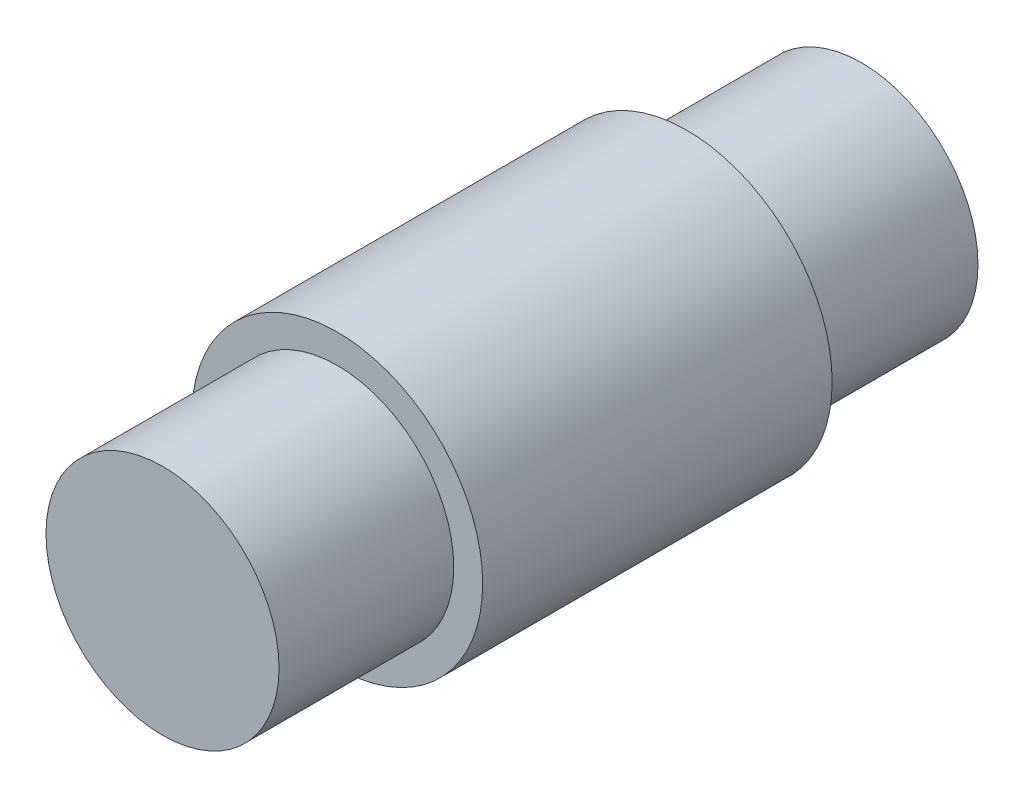
ISO-10303-21;
HEADER;
FILE_DESCRIPTION(('STEP AP214'),'2;1');
FILE_NAME('part.step','',(''),(''),'','','');
FILE_SCHEMA(('AUTOMOTIVE_DESIGN { 1 0 10303 214 1 1 1 1 }'));
ENDSEC;
DATA;
#1=APPLICATION_CONTEXT('core data for automotive mechanical design processes');
#2=APPLICATION_PROTOCOL_DEFINITION('international standard','automotive_design',2000,#1);
#3=PRODUCT_CONTEXT('',#1,'mechanical');
#4=PRODUCT('Part','Part','',(#3));
#5=PRODUCT_RELATED_PRODUCT_CATEGORY('part','',(#4));
#6=PRODUCT_DEFINITION_FORMATION('','',#4);
#7=PRODUCT_DEFINITION_CONTEXT('part definition',#1,'design');
#8=PRODUCT_DEFINITION('design','',#6,#7);
#9=PRODUCT_DEFINITION_SHAPE('','',#8);
#10=(LENGTH_UNIT() NAMED_UNIT(*) SI_UNIT(.MILLI.,.METRE.));
#11=(NAMED_UNIT(*) PLANE_ANGLE_UNIT() SI_UNIT($,.RADIAN.));
#12=(NAMED_UNIT(*) SI_UNIT($,.STERADIAN.) SOLID_ANGLE_UNIT());
#13=UNCERTAINTY_MEASURE_WITH_UNIT(LENGTH_MEASURE(1.E-05),#10,'distance_accuracy_value','');
#14=(GEOMETRIC_REPRESENTATION_CONTEXT(3) GLOBAL_UNCERTAINTY_ASSIGNED_CONTEXT((#13)) GLOBAL_UNIT_ASSIGNED_CONTEXT((#10,
#11,#12)) REPRESENTATION_CONTEXT('',''));
#15=CARTESIAN_POINT('',(0.,0.,0.));
#16=DIRECTION('',(0.,0.,1.));
#17=DIRECTION('',(1.,0.,0.));
#18=AXIS2_PLACEMENT_3D('',#15,#16,#17);
#19=CARTESIAN_POINT('',(0.,0.,4.7625));
#20=DIRECTION('',(0.,0.,-1.));
#21=DIRECTION('',(-1.,0.,0.));
#22=AXIS2_PLACEMENT_3D('',#19,#20,#21);
#23=CYLINDRICAL_SURFACE('',#22,3.9624);
#24=CARTESIAN_POINT('',(0.,0.,4.7625));
#25=DIRECTION('',(0.,0.,1.));
#26=DIRECTION('',(1.,0.,0.));
#27=AXIS2_PLACEMENT_3D('',#24,#25,#26);
#28=CIRCLE('',#27,3.9624);
#29=CARTESIAN_POINT('',(3.9624,0.,4.7625));
#30=VERTEX_POINT('',#29);
#31=EDGE_CURVE('E40',#30,#30,#28,.T.);
#32=ORIENTED_EDGE('',*,*,#31,.F.);
#33=EDGE_LOOP('',(#32));
#34=FACE_BOUND('',#33,.T.);
#35=CARTESIAN_POINT('',(0.,0.,-4.7625));
#36=DIRECTION('',(0.,0.,1.));
#37=DIRECTION('',(1.,0.,0.));
#38=AXIS2_PLACEMENT_3D('',#35,#36,#37);
#39=CIRCLE('',#38,3.9624);
#40=CARTESIAN_POINT('',(3.9624,0.,-4.7625));
#41=VERTEX_POINT('',#40);
#42=EDGE_CURVE('E44',#41,#41,#39,.T.);
#43=ORIENTED_EDGE('',*,*,#42,.T.);
#44=EDGE_LOOP('',(#43));
#45=FACE_BOUND('',#44,.T.);
#46=ADVANCED_FACE('F34',(#34,#45),#23,.T.);
#47=CARTESIAN_POINT('',(0.,0.,4.7625));
#48=DIRECTION('',(0.,0.,1.));
#49=DIRECTION('',(1.,0.,0.));
#50=AXIS2_PLACEMENT_3D('',#47,#48,#49);
#51=PLANE('',#50);
#52=CARTESIAN_POINT('',(0.,0.,4.7625));
#53=DIRECTION('',(0.,0.,1.));
#54=DIRECTION('',(1.,0.,0.));
#55=AXIS2_PLACEMENT_3D('',#52,#53,#54);
#56=CIRCLE('',#55,3.175);
#57=CARTESIAN_POINT('',(3.175,0.,4.7625));
#58=VERTEX_POINT('',#57);
#59=EDGE_CURVE('E49',#58,#58,#56,.F.);
#60=ORIENTED_EDGE('',*,*,#59,.T.);
#61=EDGE_LOOP('',(#60));
#62=FACE_BOUND('',#61,.T.);
#63=ORIENTED_EDGE('',*,*,#31,.T.);
#64=EDGE_LOOP('',(#63));
#65=FACE_BOUND('',#64,.T.);
#66=ADVANCED_FACE('F78',(#62,#65),#51,.T.);
#67=CARTESIAN_POINT('',(0.,0.,-4.7625));
#68=DIRECTION('',(0.,0.,1.));
#69=DIRECTION('',(1.,0.,0.));
#70=AXIS2_PLACEMENT_3D('',#67,#68,#69);
#71=PLANE('',#70);
#72=CARTESIAN_POINT('',(0.,0.,-4.7625));
#73=DIRECTION('',(0.,0.,1.));
#74=DIRECTION('',(1.,0.,0.));
#75=AXIS2_PLACEMENT_3D('',#72,#73,#74);
#76=CIRCLE('',#75,3.175);
#77=CARTESIAN_POINT('',(3.175,0.,-4.7625));
#78=VERTEX_POINT('',#77);
#79=EDGE_CURVE('E10',#78,#78,#76,.F.);
#80=ORIENTED_EDGE('',*,*,#79,.F.);
#81=EDGE_LOOP('',(#80));
#82=FACE_BOUND('',#81,.T.);
#83=ORIENTED_EDGE('',*,*,#42,.F.);
#84=EDGE_LOOP('',(#83));
#85=FACE_BOUND('',#84,.T.);
#86=ADVANCED_FACE('F83',(#82,#85),#71,.F.);
#87=CARTESIAN_POINT('',(0.,0.,-9.525));
#88=DIRECTION('',(0.,0.,1.));
#89=DIRECTION('',(1.,0.,0.));
#90=AXIS2_PLACEMENT_3D('',#87,#88,#89);
#91=PLANE('',#90);
#92=CARTESIAN_POINT('',(0.,0.,-9.525));
#93=DIRECTION('',(0.,0.,1.));
#94=DIRECTION('',(1.,0.,0.));
#95=AXIS2_PLACEMENT_3D('',#92,#93,#94);
#96=CIRCLE('',#95,3.175);
#97=CARTESIAN_POINT('',(3.175,0.,-9.525));
#98=VERTEX_POINT('',#97);
#99=EDGE_CURVE('E54',#98,#98,#96,.T.);
#100=ORIENTED_EDGE('',*,*,#99,.F.);
#101=EDGE_LOOP('',(#100));
#102=FACE_BOUND('',#101,.T.);
#103=ADVANCED_FACE('F72',(#102),#91,.F.);
#104=CARTESIAN_POINT('',(0.,0.,9.525));
#105=DIRECTION('',(0.,0.,-1.));
#106=DIRECTION('',(-1.,0.,0.));
#107=AXIS2_PLACEMENT_3D('',#104,#105,#106);
#108=CYLINDRICAL_SURFACE('',#107,3.175);
#109=ORIENTED_EDGE('',*,*,#99,.T.);
#110=EDGE_LOOP('',(#109));
#111=FACE_BOUND('',#110,.T.);
#112=ORIENTED_EDGE('',*,*,#79,.T.);
#113=EDGE_LOOP('',(#112));
#114=FACE_BOUND('',#113,.T.);
#115=ADVANCED_FACE('F64',(#111,#114),#108,.T.);
#116=ORIENTED_EDGE('',*,*,#59,.F.);
#117=EDGE_LOOP('',(#116));
#118=FACE_BOUND('',#117,.T.);
#119=CARTESIAN_POINT('',(0.,0.,9.525));
#120=DIRECTION('',(0.,0.,1.));
#121=DIRECTION('',(1.,0.,0.));
#122=AXIS2_PLACEMENT_3D('',#119,#120,#121);
#123=CIRCLE('',#122,3.175);
#124=CARTESIAN_POINT('',(3.175,0.,9.525));
#125=VERTEX_POINT('',#124);
#126=EDGE_CURVE('E53',#125,#125,#123,.T.);
#127=ORIENTED_EDGE('',*,*,#126,.F.);
#128=EDGE_LOOP('',(#127));
#129=FACE_BOUND('',#128,.T.);
#130=ADVANCED_FACE('F62',(#118,#129),#108,.T.);
#131=CARTESIAN_POINT('',(0.,0.,9.525));
#132=DIRECTION('',(0.,0.,1.));
#133=DIRECTION('',(1.,0.,0.));
#134=AXIS2_PLACEMENT_3D('',#131,#132,#133);
#135=PLANE('',#134);
#136=ORIENTED_EDGE('',*,*,#126,.T.);
#137=EDGE_LOOP('',(#136));
#138=FACE_BOUND('',#137,.T.);
#139=ADVANCED_FACE('F60',(#138),#135,.T.);
#140=CLOSED_SHELL('',(#46,#66,#86,#103,#115,#130,#139));
#141=MANIFOLD_SOLID_BREP('B2',#140);
#142=ADVANCED_BREP_SHAPE_REPRESENTATION('',(#18,#141),#14);
#143=SHAPE_DEFINITION_REPRESENTATION(#9,#142);
ENDSEC;
END-ISO-10303-21;
